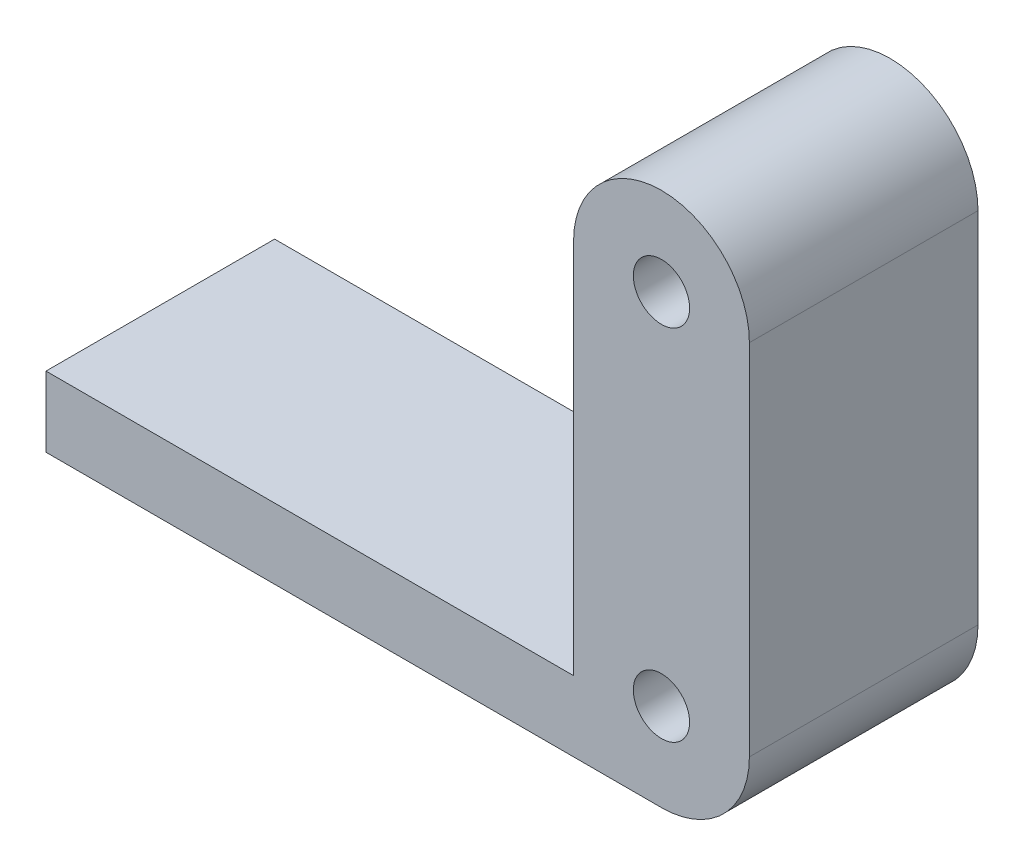
ISO-10303-21;
HEADER;
FILE_DESCRIPTION(('STEP AP214'),'2;1');
FILE_NAME('part.step','',(''),(''),'','','');
FILE_SCHEMA(('AUTOMOTIVE_DESIGN { 1 0 10303 214 1 1 1 1 }'));
ENDSEC;
DATA;
#1=APPLICATION_CONTEXT('core data for automotive mechanical design processes');
#2=APPLICATION_PROTOCOL_DEFINITION('international standard','automotive_design',2000,#1);
#3=PRODUCT_CONTEXT('',#1,'mechanical');
#4=PRODUCT('Part','Part','',(#3));
#5=PRODUCT_RELATED_PRODUCT_CATEGORY('part','',(#4));
#6=PRODUCT_DEFINITION_FORMATION('','',#4);
#7=PRODUCT_DEFINITION_CONTEXT('part definition',#1,'design');
#8=PRODUCT_DEFINITION('design','',#6,#7);
#9=PRODUCT_DEFINITION_SHAPE('','',#8);
#10=(LENGTH_UNIT() NAMED_UNIT(*) SI_UNIT(.MILLI.,.METRE.));
#11=(NAMED_UNIT(*) PLANE_ANGLE_UNIT() SI_UNIT($,.RADIAN.));
#12=(NAMED_UNIT(*) SI_UNIT($,.STERADIAN.) SOLID_ANGLE_UNIT());
#13=UNCERTAINTY_MEASURE_WITH_UNIT(LENGTH_MEASURE(1.E-05),#10,'distance_accuracy_value','');
#14=(GEOMETRIC_REPRESENTATION_CONTEXT(3) GLOBAL_UNCERTAINTY_ASSIGNED_CONTEXT((#13)) GLOBAL_UNIT_ASSIGNED_CONTEXT((#10,
#11,#12)) REPRESENTATION_CONTEXT('',''));
#15=CARTESIAN_POINT('',(0.,0.,0.));
#16=DIRECTION('',(0.,0.,1.));
#17=DIRECTION('',(1.,0.,0.));
#18=AXIS2_PLACEMENT_3D('',#15,#16,#17);
#19=CARTESIAN_POINT('',(35.,0.999999999999997,13.));
#20=DIRECTION('',(0.,0.,-1.));
#21=DIRECTION('',(-1.,0.,0.));
#22=AXIS2_PLACEMENT_3D('',#19,#20,#21);
#23=CYLINDRICAL_SURFACE('',#22,5.);
#24=DIRECTION('',(0.,0.,-1.));
#25=VECTOR('',#24,1.);
#26=CARTESIAN_POINT('',(40.,1.,13.));
#27=LINE('',#26,#25);
#28=CARTESIAN_POINT('',(40.,1.,13.));
#29=VERTEX_POINT('',#28);
#30=CARTESIAN_POINT('',(40.,1.,0.));
#31=VERTEX_POINT('',#30);
#32=EDGE_CURVE('E148',#29,#31,#27,.T.);
#33=ORIENTED_EDGE('',*,*,#32,.F.);
#34=CARTESIAN_POINT('',(35.,0.999999999999997,13.));
#35=DIRECTION('',(0.,0.,-1.));
#36=DIRECTION('',(-1.,0.,0.));
#37=AXIS2_PLACEMENT_3D('',#34,#35,#36);
#38=CIRCLE('',#37,5.);
#39=CARTESIAN_POINT('',(35.,-4.,13.));
#40=VERTEX_POINT('',#39);
#41=EDGE_CURVE('E49',#40,#29,#38,.F.);
#42=ORIENTED_EDGE('',*,*,#41,.F.);
#43=DIRECTION('',(0.,0.,-1.));
#44=VECTOR('',#43,1.);
#45=CARTESIAN_POINT('',(35.,-4.,13.));
#46=LINE('',#45,#44);
#47=CARTESIAN_POINT('',(35.,-4.,0.));
#48=VERTEX_POINT('',#47);
#49=EDGE_CURVE('E104',#48,#40,#46,.F.);
#50=ORIENTED_EDGE('',*,*,#49,.F.);
#51=CARTESIAN_POINT('',(35.,0.999999999999997,0.));
#52=DIRECTION('',(0.,0.,-1.));
#53=DIRECTION('',(-1.,0.,0.));
#54=AXIS2_PLACEMENT_3D('',#51,#52,#53);
#55=CIRCLE('',#54,5.);
#56=EDGE_CURVE('E11',#31,#48,#55,.T.);
#57=ORIENTED_EDGE('',*,*,#56,.F.);
#58=EDGE_LOOP('',(#33,#42,#50,#57));
#59=FACE_BOUND('',#58,.T.);
#60=ADVANCED_FACE('F41',(#59),#23,.T.);
#61=CARTESIAN_POINT('',(35.,21.4,0.));
#62=DIRECTION('',(0.,0.,-1.));
#63=DIRECTION('',(-1.,0.,0.));
#64=AXIS2_PLACEMENT_3D('',#61,#62,#63);
#65=CYLINDRICAL_SURFACE('',#64,5.00000000000001);
#66=DIRECTION('',(0.,0.,-1.));
#67=VECTOR('',#66,1.);
#68=CARTESIAN_POINT('',(40.,21.4,13.));
#69=LINE('',#68,#67);
#70=CARTESIAN_POINT('',(40.,21.4,0.));
#71=VERTEX_POINT('',#70);
#72=CARTESIAN_POINT('',(40.,21.4,13.));
#73=VERTEX_POINT('',#72);
#74=EDGE_CURVE('E125',#71,#73,#69,.F.);
#75=ORIENTED_EDGE('',*,*,#74,.F.);
#76=CARTESIAN_POINT('',(35.,21.4,0.));
#77=DIRECTION('',(0.,0.,-1.));
#78=DIRECTION('',(-1.,0.,0.));
#79=AXIS2_PLACEMENT_3D('',#76,#77,#78);
#80=CIRCLE('',#79,5.00000000000001);
#81=CARTESIAN_POINT('',(30.,21.4,0.));
#82=VERTEX_POINT('',#81);
#83=EDGE_CURVE('E141',#82,#71,#80,.T.);
#84=ORIENTED_EDGE('',*,*,#83,.F.);
#85=DIRECTION('',(0.,0.,-1.));
#86=VECTOR('',#85,1.);
#87=CARTESIAN_POINT('',(30.,21.4,13.));
#88=LINE('',#87,#86);
#89=CARTESIAN_POINT('',(30.,21.4,13.));
#90=VERTEX_POINT('',#89);
#91=EDGE_CURVE('E131',#90,#82,#88,.T.);
#92=ORIENTED_EDGE('',*,*,#91,.F.);
#93=CARTESIAN_POINT('',(35.,21.4,13.));
#94=DIRECTION('',(0.,0.,-1.));
#95=DIRECTION('',(-1.,0.,0.));
#96=AXIS2_PLACEMENT_3D('',#93,#94,#95);
#97=CIRCLE('',#96,5.00000000000001);
#98=EDGE_CURVE('E145',#73,#90,#97,.F.);
#99=ORIENTED_EDGE('',*,*,#98,.F.);
#100=EDGE_LOOP('',(#75,#84,#92,#99));
#101=FACE_BOUND('',#100,.T.);
#102=ADVANCED_FACE('F193',(#101),#65,.T.);
#103=CARTESIAN_POINT('',(0.,0.,13.));
#104=DIRECTION('',(0.,0.,-1.));
#105=DIRECTION('',(-1.,0.,0.));
#106=AXIS2_PLACEMENT_3D('',#103,#104,#105);
#107=PLANE('',#106);
#108=DIRECTION('',(1.,0.,0.));
#109=VECTOR('',#108,1.);
#110=CARTESIAN_POINT('',(40.,-4.,13.));
#111=LINE('',#110,#109);
#112=CARTESIAN_POINT('',(0.,-4.00000000000001,13.));
#113=VERTEX_POINT('',#112);
#114=EDGE_CURVE('E97',#113,#40,#111,.T.);
#115=ORIENTED_EDGE('',*,*,#114,.T.);
#116=ORIENTED_EDGE('',*,*,#41,.T.);
#117=DIRECTION('',(0.,1.,0.));
#118=VECTOR('',#117,1.);
#119=CARTESIAN_POINT('',(40.,26.4,13.));
#120=LINE('',#119,#118);
#121=EDGE_CURVE('E107',#29,#73,#120,.T.);
#122=ORIENTED_EDGE('',*,*,#121,.T.);
#123=ORIENTED_EDGE('',*,*,#98,.T.);
#124=DIRECTION('',(0.,-1.,0.));
#125=VECTOR('',#124,1.);
#126=CARTESIAN_POINT('',(30.,0.,13.));
#127=LINE('',#126,#125);
#128=CARTESIAN_POINT('',(30.,0.,13.));
#129=VERTEX_POINT('',#128);
#130=EDGE_CURVE('E160',#90,#129,#127,.T.);
#131=ORIENTED_EDGE('',*,*,#130,.T.);
#132=DIRECTION('',(-1.,0.,0.));
#133=VECTOR('',#132,1.);
#134=CARTESIAN_POINT('',(0.,0.,13.));
#135=LINE('',#134,#133);
#136=CARTESIAN_POINT('',(0.,0.,13.));
#137=VERTEX_POINT('',#136);
#138=EDGE_CURVE('E114',#129,#137,#135,.T.);
#139=ORIENTED_EDGE('',*,*,#138,.T.);
#140=DIRECTION('',(0.,-1.,0.));
#141=VECTOR('',#140,1.);
#142=CARTESIAN_POINT('',(0.,-4.00000000000001,13.));
#143=LINE('',#142,#141);
#144=EDGE_CURVE('E108',#137,#113,#143,.T.);
#145=ORIENTED_EDGE('',*,*,#144,.T.);
#146=EDGE_LOOP('',(#115,#116,#122,#123,#131,#139,#145));
#147=FACE_BOUND('',#146,.T.);
#148=CARTESIAN_POINT('',(35.,21.4,13.));
#149=DIRECTION('',(0.,0.,1.));
#150=DIRECTION('',(1.,0.,0.));
#151=AXIS2_PLACEMENT_3D('',#148,#149,#150);
#152=CIRCLE('',#151,1.6);
#153=CARTESIAN_POINT('',(33.4,21.4,13.));
#154=VERTEX_POINT('',#153);
#155=EDGE_CURVE('E170',#154,#154,#152,.T.);
#156=ORIENTED_EDGE('',*,*,#155,.F.);
#157=EDGE_LOOP('',(#156));
#158=FACE_BOUND('',#157,.T.);
#159=CARTESIAN_POINT('',(35.,0.999999999999997,13.));
#160=DIRECTION('',(0.,0.,1.));
#161=DIRECTION('',(1.,0.,0.));
#162=AXIS2_PLACEMENT_3D('',#159,#160,#161);
#163=CIRCLE('',#162,1.6);
#164=CARTESIAN_POINT('',(33.4,0.999999999999997,13.));
#165=VERTEX_POINT('',#164);
#166=EDGE_CURVE('E229',#165,#165,#163,.T.);
#167=ORIENTED_EDGE('',*,*,#166,.F.);
#168=EDGE_LOOP('',(#167));
#169=FACE_BOUND('',#168,.T.);
#170=ADVANCED_FACE('F111',(#147,#158,#169),#107,.F.);
#171=CARTESIAN_POINT('',(0.,0.,0.));
#172=DIRECTION('',(0.,0.,-1.));
#173=DIRECTION('',(-1.,0.,0.));
#174=AXIS2_PLACEMENT_3D('',#171,#172,#173);
#175=PLANE('',#174);
#176=CARTESIAN_POINT('',(35.,21.4,0.));
#177=DIRECTION('',(0.,0.,1.));
#178=DIRECTION('',(1.,0.,0.));
#179=AXIS2_PLACEMENT_3D('',#176,#177,#178);
#180=CIRCLE('',#179,1.6);
#181=CARTESIAN_POINT('',(33.4,21.4,0.));
#182=VERTEX_POINT('',#181);
#183=EDGE_CURVE('E236',#182,#182,#180,.T.);
#184=ORIENTED_EDGE('',*,*,#183,.T.);
#185=EDGE_LOOP('',(#184));
#186=FACE_BOUND('',#185,.T.);
#187=DIRECTION('',(0.,1.,0.));
#188=VECTOR('',#187,1.);
#189=CARTESIAN_POINT('',(40.,26.4,0.));
#190=LINE('',#189,#188);
#191=EDGE_CURVE('E173',#31,#71,#190,.T.);
#192=ORIENTED_EDGE('',*,*,#191,.F.);
#193=ORIENTED_EDGE('',*,*,#56,.T.);
#194=DIRECTION('',(1.,0.,0.));
#195=VECTOR('',#194,1.);
#196=CARTESIAN_POINT('',(40.,-4.,0.));
#197=LINE('',#196,#195);
#198=CARTESIAN_POINT('',(0.,-4.00000000000001,0.));
#199=VERTEX_POINT('',#198);
#200=EDGE_CURVE('E169',#199,#48,#197,.T.);
#201=ORIENTED_EDGE('',*,*,#200,.F.);
#202=DIRECTION('',(0.,-1.,0.));
#203=VECTOR('',#202,1.);
#204=CARTESIAN_POINT('',(0.,-4.00000000000001,0.));
#205=LINE('',#204,#203);
#206=CARTESIAN_POINT('',(0.,0.,0.));
#207=VERTEX_POINT('',#206);
#208=EDGE_CURVE('E123',#207,#199,#205,.T.);
#209=ORIENTED_EDGE('',*,*,#208,.F.);
#210=DIRECTION('',(-1.,0.,0.));
#211=VECTOR('',#210,1.);
#212=CARTESIAN_POINT('',(0.,0.,0.));
#213=LINE('',#212,#211);
#214=CARTESIAN_POINT('',(30.,0.,0.));
#215=VERTEX_POINT('',#214);
#216=EDGE_CURVE('E119',#215,#207,#213,.T.);
#217=ORIENTED_EDGE('',*,*,#216,.F.);
#218=DIRECTION('',(0.,-1.,0.));
#219=VECTOR('',#218,1.);
#220=CARTESIAN_POINT('',(30.,0.,0.));
#221=LINE('',#220,#219);
#222=EDGE_CURVE('E176',#82,#215,#221,.T.);
#223=ORIENTED_EDGE('',*,*,#222,.F.);
#224=ORIENTED_EDGE('',*,*,#83,.T.);
#225=EDGE_LOOP('',(#192,#193,#201,#209,#217,#223,#224));
#226=FACE_BOUND('',#225,.T.);
#227=CARTESIAN_POINT('',(35.,0.999999999999997,0.));
#228=DIRECTION('',(0.,0.,1.));
#229=DIRECTION('',(1.,0.,0.));
#230=AXIS2_PLACEMENT_3D('',#227,#228,#229);
#231=CIRCLE('',#230,1.6);
#232=CARTESIAN_POINT('',(33.4,0.999999999999997,0.));
#233=VERTEX_POINT('',#232);
#234=EDGE_CURVE('E232',#233,#233,#231,.T.);
#235=ORIENTED_EDGE('',*,*,#234,.T.);
#236=EDGE_LOOP('',(#235));
#237=FACE_BOUND('',#236,.T.);
#238=ADVANCED_FACE('F183',(#186,#226,#237),#175,.T.);
#239=CARTESIAN_POINT('',(0.,-4.00000000000001,13.));
#240=DIRECTION('',(1.,0.,0.));
#241=DIRECTION('',(0.,0.,-1.));
#242=AXIS2_PLACEMENT_3D('',#239,#240,#241);
#243=PLANE('',#242);
#244=ORIENTED_EDGE('',*,*,#208,.T.);
#245=DIRECTION('',(0.,0.,-1.));
#246=VECTOR('',#245,1.);
#247=CARTESIAN_POINT('',(0.,-4.00000000000001,13.));
#248=LINE('',#247,#246);
#249=EDGE_CURVE('E102',#113,#199,#248,.T.);
#250=ORIENTED_EDGE('',*,*,#249,.F.);
#251=ORIENTED_EDGE('',*,*,#144,.F.);
#252=DIRECTION('',(0.,0.,-1.));
#253=VECTOR('',#252,1.);
#254=CARTESIAN_POINT('',(0.,0.,13.));
#255=LINE('',#254,#253);
#256=EDGE_CURVE('E134',#137,#207,#255,.T.);
#257=ORIENTED_EDGE('',*,*,#256,.T.);
#258=EDGE_LOOP('',(#244,#250,#251,#257));
#259=FACE_BOUND('',#258,.T.);
#260=ADVANCED_FACE('F121',(#259),#243,.F.);
#261=CARTESIAN_POINT('',(40.,-4.,13.));
#262=DIRECTION('',(0.,1.,0.));
#263=DIRECTION('',(-1.,0.,0.));
#264=AXIS2_PLACEMENT_3D('',#261,#262,#263);
#265=PLANE('',#264);
#266=ORIENTED_EDGE('',*,*,#200,.T.);
#267=ORIENTED_EDGE('',*,*,#49,.T.);
#268=ORIENTED_EDGE('',*,*,#114,.F.);
#269=ORIENTED_EDGE('',*,*,#249,.T.);
#270=EDGE_LOOP('',(#266,#267,#268,#269));
#271=FACE_BOUND('',#270,.T.);
#272=ADVANCED_FACE('F100',(#271),#265,.F.);
#273=CARTESIAN_POINT('',(40.,26.4,13.));
#274=DIRECTION('',(-1.,0.,0.));
#275=DIRECTION('',(0.,-1.,0.));
#276=AXIS2_PLACEMENT_3D('',#273,#274,#275);
#277=PLANE('',#276);
#278=ORIENTED_EDGE('',*,*,#121,.F.);
#279=ORIENTED_EDGE('',*,*,#32,.T.);
#280=ORIENTED_EDGE('',*,*,#191,.T.);
#281=ORIENTED_EDGE('',*,*,#74,.T.);
#282=EDGE_LOOP('',(#278,#279,#280,#281));
#283=FACE_BOUND('',#282,.T.);
#284=ADVANCED_FACE('F157',(#283),#277,.F.);
#285=CARTESIAN_POINT('',(30.,0.,13.));
#286=DIRECTION('',(1.,0.,0.));
#287=DIRECTION('',(0.,0.,-1.));
#288=AXIS2_PLACEMENT_3D('',#285,#286,#287);
#289=PLANE('',#288);
#290=ORIENTED_EDGE('',*,*,#130,.F.);
#291=ORIENTED_EDGE('',*,*,#91,.T.);
#292=ORIENTED_EDGE('',*,*,#222,.T.);
#293=DIRECTION('',(0.,0.,-1.));
#294=VECTOR('',#293,1.);
#295=CARTESIAN_POINT('',(30.,0.,13.));
#296=LINE('',#295,#294);
#297=EDGE_CURVE('E126',#129,#215,#296,.T.);
#298=ORIENTED_EDGE('',*,*,#297,.F.);
#299=EDGE_LOOP('',(#290,#291,#292,#298));
#300=FACE_BOUND('',#299,.T.);
#301=ADVANCED_FACE('F190',(#300),#289,.F.);
#302=CARTESIAN_POINT('',(0.,0.,13.));
#303=DIRECTION('',(0.,-1.,0.));
#304=DIRECTION('',(0.,0.,-1.));
#305=AXIS2_PLACEMENT_3D('',#302,#303,#304);
#306=PLANE('',#305);
#307=ORIENTED_EDGE('',*,*,#216,.T.);
#308=ORIENTED_EDGE('',*,*,#256,.F.);
#309=ORIENTED_EDGE('',*,*,#138,.F.);
#310=ORIENTED_EDGE('',*,*,#297,.T.);
#311=EDGE_LOOP('',(#307,#308,#309,#310));
#312=FACE_BOUND('',#311,.T.);
#313=ADVANCED_FACE('F186',(#312),#306,.F.);
#314=CARTESIAN_POINT('',(35.,21.4,13.));
#315=DIRECTION('',(0.,0.,-1.));
#316=DIRECTION('',(-1.,0.,0.));
#317=AXIS2_PLACEMENT_3D('',#314,#315,#316);
#318=CYLINDRICAL_SURFACE('',#317,1.6);
#319=CARTESIAN_POINT('',(33.4,21.4,13.));
#320=CARTESIAN_POINT('',(33.4,21.4,12.8645833333333));
#321=CARTESIAN_POINT('',(33.4,21.4,12.7291666666667));
#322=CARTESIAN_POINT('',(33.4,21.4,12.4583333333333));
#323=CARTESIAN_POINT('',(33.4,21.4,12.3229166666667));
#324=CARTESIAN_POINT('',(33.4,21.4,12.0520833333333));
#325=CARTESIAN_POINT('',(33.4,21.4,11.9166666666667));
#326=CARTESIAN_POINT('',(33.4,21.4,11.6458333333333));
#327=CARTESIAN_POINT('',(33.4,21.4,11.5104166666667));
#328=CARTESIAN_POINT('',(33.4,21.4,11.2395833333333));
#329=CARTESIAN_POINT('',(33.4,21.4,11.1041666666667));
#330=CARTESIAN_POINT('',(33.4,21.4,10.8333333333333));
#331=CARTESIAN_POINT('',(33.4,21.4,10.6979166666667));
#332=CARTESIAN_POINT('',(33.4,21.4,10.4270833333333));
#333=CARTESIAN_POINT('',(33.4,21.4,10.2916666666667));
#334=CARTESIAN_POINT('',(33.4,21.4,10.0208333333333));
#335=CARTESIAN_POINT('',(33.4,21.4,9.88541666666667));
#336=CARTESIAN_POINT('',(33.4,21.4,9.61458333333333));
#337=CARTESIAN_POINT('',(33.4,21.4,9.47916666666667));
#338=CARTESIAN_POINT('',(33.4,21.4,9.20833333333333));
#339=CARTESIAN_POINT('',(33.4,21.4,9.07291666666666));
#340=CARTESIAN_POINT('',(33.4,21.4,8.80208333333333));
#341=CARTESIAN_POINT('',(33.4,21.4,8.66666666666667));
#342=CARTESIAN_POINT('',(33.4,21.4,8.39583333333333));
#343=CARTESIAN_POINT('',(33.4,21.4,8.26041666666667));
#344=CARTESIAN_POINT('',(33.4,21.4,7.98958333333333));
#345=CARTESIAN_POINT('',(33.4,21.4,7.85416666666667));
#346=CARTESIAN_POINT('',(33.4,21.4,7.58333333333333));
#347=CARTESIAN_POINT('',(33.4,21.4,7.44791666666667));
#348=CARTESIAN_POINT('',(33.4,21.4,7.17708333333333));
#349=CARTESIAN_POINT('',(33.4,21.4,7.04166666666667));
#350=CARTESIAN_POINT('',(33.4,21.4,6.77083333333333));
#351=CARTESIAN_POINT('',(33.4,21.4,6.63541666666667));
#352=CARTESIAN_POINT('',(33.4,21.4,6.36458333333333));
#353=CARTESIAN_POINT('',(33.4,21.4,6.22916666666667));
#354=CARTESIAN_POINT('',(33.4,21.4,5.95833333333333));
#355=CARTESIAN_POINT('',(33.4,21.4,5.82291666666667));
#356=CARTESIAN_POINT('',(33.4,21.4,5.55208333333333));
#357=CARTESIAN_POINT('',(33.4,21.4,5.41666666666667));
#358=CARTESIAN_POINT('',(33.4,21.4,5.14583333333333));
#359=CARTESIAN_POINT('',(33.4,21.4,5.01041666666667));
#360=CARTESIAN_POINT('',(33.4,21.4,4.73958333333333));
#361=CARTESIAN_POINT('',(33.4,21.4,4.60416666666667));
#362=CARTESIAN_POINT('',(33.4,21.4,4.33333333333333));
#363=CARTESIAN_POINT('',(33.4,21.4,4.19791666666667));
#364=CARTESIAN_POINT('',(33.4,21.4,3.92708333333333));
#365=CARTESIAN_POINT('',(33.4,21.4,3.79166666666667));
#366=CARTESIAN_POINT('',(33.4,21.4,3.52083333333333));
#367=CARTESIAN_POINT('',(33.4,21.4,3.38541666666667));
#368=CARTESIAN_POINT('',(33.4,21.4,3.11458333333333));
#369=CARTESIAN_POINT('',(33.4,21.4,2.97916666666667));
#370=CARTESIAN_POINT('',(33.4,21.4,2.70833333333333));
#371=CARTESIAN_POINT('',(33.4,21.4,2.57291666666667));
#372=CARTESIAN_POINT('',(33.4,21.4,2.30208333333333));
#373=CARTESIAN_POINT('',(33.4,21.4,2.16666666666667));
#374=CARTESIAN_POINT('',(33.4,21.4,1.89583333333333));
#375=CARTESIAN_POINT('',(33.4,21.4,1.76041666666667));
#376=CARTESIAN_POINT('',(33.4,21.4,1.48958333333333));
#377=CARTESIAN_POINT('',(33.4,21.4,1.35416666666667));
#378=CARTESIAN_POINT('',(33.4,21.4,1.08333333333333));
#379=CARTESIAN_POINT('',(33.4,21.4,0.947916666666667));
#380=CARTESIAN_POINT('',(33.4,21.4,0.677083333333334));
#381=CARTESIAN_POINT('',(33.4,21.4,0.541666666666667));
#382=CARTESIAN_POINT('',(33.4,21.4,0.270833333333334));
#383=CARTESIAN_POINT('',(33.4,21.4,0.135416666666667));
#384=CARTESIAN_POINT('',(33.4,21.4,0.));
#385=B_SPLINE_CURVE_WITH_KNOTS('',3,(#319,#320,#321,#322,#323,#324,#325,#326,#327,#328,#329,
#330,#331,#332,#333,#334,#335,#336,#337,#338,#339,#340,#341,#342,#343,#344,#345,#346,#347,#348,
#349,#350,#351,#352,#353,#354,#355,#356,#357,#358,#359,#360,#361,#362,#363,#364,#365,#366,#367,
#368,#369,#370,#371,#372,#373,#374,#375,#376,#377,#378,#379,#380,#381,#382,#383,#384),
.UNSPECIFIED.,.F.,.F.,(4,2,2,2,2,2,2,2,2,2,2,2,2,2,2,2,2,2,2,2,2,2,2,2,2,2,2,2,2,2,2,2,4),(0.,
0.40625,0.812500000000001,1.21875,1.625,2.03125,2.4375,2.84375,3.25,3.65625,4.0625,4.46875,
4.875,5.28125,5.6875,6.09375,6.5,6.90625,7.3125,7.71875,8.125,8.53125,8.9375,9.34375,9.75,
10.15625,10.5625,10.96875,11.375,11.78125,12.1875,12.59375,13.),.UNSPECIFIED.);
#386=EDGE_CURVE('BSEAM214',#154,#182,#385,.T.);
#387=ORIENTED_EDGE('',*,*,#155,.T.);
#388=ORIENTED_EDGE('',*,*,#183,.F.);
#389=ORIENTED_EDGE('',*,*,#386,.T.);
#390=ORIENTED_EDGE('',*,*,#386,.F.);
#391=EDGE_LOOP('',(#387,#389,#388,#390));
#392=FACE_BOUND('',#391,.T.);
#393=ADVANCED_FACE('F214',(#392),#318,.F.);
#394=CARTESIAN_POINT('',(35.,0.999999999999997,13.));
#395=DIRECTION('',(0.,0.,-1.));
#396=DIRECTION('',(-1.,0.,0.));
#397=AXIS2_PLACEMENT_3D('',#394,#395,#396);
#398=CYLINDRICAL_SURFACE('',#397,1.6);
#399=CARTESIAN_POINT('',(33.4,0.999999999999997,13.));
#400=CARTESIAN_POINT('',(33.4,0.999999999999997,12.8645833333333));
#401=CARTESIAN_POINT('',(33.4,0.999999999999997,12.7291666666667));
#402=CARTESIAN_POINT('',(33.4,0.999999999999997,12.4583333333333));
#403=CARTESIAN_POINT('',(33.4,0.999999999999997,12.3229166666667));
#404=CARTESIAN_POINT('',(33.4,0.999999999999997,12.0520833333333));
#405=CARTESIAN_POINT('',(33.4,0.999999999999997,11.9166666666667));
#406=CARTESIAN_POINT('',(33.4,0.999999999999997,11.6458333333333));
#407=CARTESIAN_POINT('',(33.4,0.999999999999997,11.5104166666667));
#408=CARTESIAN_POINT('',(33.4,0.999999999999997,11.2395833333333));
#409=CARTESIAN_POINT('',(33.4,0.999999999999997,11.1041666666667));
#410=CARTESIAN_POINT('',(33.4,0.999999999999997,10.8333333333333));
#411=CARTESIAN_POINT('',(33.4,0.999999999999997,10.6979166666667));
#412=CARTESIAN_POINT('',(33.4,0.999999999999997,10.4270833333333));
#413=CARTESIAN_POINT('',(33.4,0.999999999999997,10.2916666666667));
#414=CARTESIAN_POINT('',(33.4,0.999999999999997,10.0208333333333));
#415=CARTESIAN_POINT('',(33.4,0.999999999999997,9.88541666666667));
#416=CARTESIAN_POINT('',(33.4,0.999999999999997,9.61458333333333));
#417=CARTESIAN_POINT('',(33.4,0.999999999999997,9.47916666666667));
#418=CARTESIAN_POINT('',(33.4,0.999999999999997,9.20833333333333));
#419=CARTESIAN_POINT('',(33.4,0.999999999999997,9.07291666666666));
#420=CARTESIAN_POINT('',(33.4,0.999999999999997,8.80208333333333));
#421=CARTESIAN_POINT('',(33.4,0.999999999999997,8.66666666666667));
#422=CARTESIAN_POINT('',(33.4,0.999999999999997,8.39583333333333));
#423=CARTESIAN_POINT('',(33.4,0.999999999999997,8.26041666666667));
#424=CARTESIAN_POINT('',(33.4,0.999999999999997,7.98958333333333));
#425=CARTESIAN_POINT('',(33.4,0.999999999999997,7.85416666666667));
#426=CARTESIAN_POINT('',(33.4,0.999999999999997,7.58333333333333));
#427=CARTESIAN_POINT('',(33.4,0.999999999999997,7.44791666666667));
#428=CARTESIAN_POINT('',(33.4,0.999999999999997,7.17708333333333));
#429=CARTESIAN_POINT('',(33.4,0.999999999999997,7.04166666666667));
#430=CARTESIAN_POINT('',(33.4,0.999999999999997,6.77083333333333));
#431=CARTESIAN_POINT('',(33.4,0.999999999999997,6.63541666666667));
#432=CARTESIAN_POINT('',(33.4,0.999999999999997,6.36458333333333));
#433=CARTESIAN_POINT('',(33.4,0.999999999999997,6.22916666666667));
#434=CARTESIAN_POINT('',(33.4,0.999999999999997,5.95833333333333));
#435=CARTESIAN_POINT('',(33.4,0.999999999999997,5.82291666666667));
#436=CARTESIAN_POINT('',(33.4,0.999999999999997,5.55208333333333));
#437=CARTESIAN_POINT('',(33.4,0.999999999999997,5.41666666666667));
#438=CARTESIAN_POINT('',(33.4,0.999999999999997,5.14583333333333));
#439=CARTESIAN_POINT('',(33.4,0.999999999999997,5.01041666666667));
#440=CARTESIAN_POINT('',(33.4,0.999999999999997,4.73958333333333));
#441=CARTESIAN_POINT('',(33.4,0.999999999999997,4.60416666666667));
#442=CARTESIAN_POINT('',(33.4,0.999999999999997,4.33333333333333));
#443=CARTESIAN_POINT('',(33.4,0.999999999999997,4.19791666666667));
#444=CARTESIAN_POINT('',(33.4,0.999999999999997,3.92708333333333));
#445=CARTESIAN_POINT('',(33.4,0.999999999999997,3.79166666666667));
#446=CARTESIAN_POINT('',(33.4,0.999999999999997,3.52083333333333));
#447=CARTESIAN_POINT('',(33.4,0.999999999999997,3.38541666666667));
#448=CARTESIAN_POINT('',(33.4,0.999999999999997,3.11458333333333));
#449=CARTESIAN_POINT('',(33.4,0.999999999999997,2.97916666666667));
#450=CARTESIAN_POINT('',(33.4,0.999999999999997,2.70833333333333));
#451=CARTESIAN_POINT('',(33.4,0.999999999999997,2.57291666666667));
#452=CARTESIAN_POINT('',(33.4,0.999999999999997,2.30208333333333));
#453=CARTESIAN_POINT('',(33.4,0.999999999999997,2.16666666666667));
#454=CARTESIAN_POINT('',(33.4,0.999999999999997,1.89583333333333));
#455=CARTESIAN_POINT('',(33.4,0.999999999999997,1.76041666666667));
#456=CARTESIAN_POINT('',(33.4,0.999999999999997,1.48958333333333));
#457=CARTESIAN_POINT('',(33.4,0.999999999999997,1.35416666666667));
#458=CARTESIAN_POINT('',(33.4,0.999999999999997,1.08333333333333));
#459=CARTESIAN_POINT('',(33.4,0.999999999999997,0.947916666666667));
#460=CARTESIAN_POINT('',(33.4,0.999999999999997,0.677083333333334));
#461=CARTESIAN_POINT('',(33.4,0.999999999999997,0.541666666666667));
#462=CARTESIAN_POINT('',(33.4,0.999999999999997,0.270833333333334));
#463=CARTESIAN_POINT('',(33.4,0.999999999999997,0.135416666666667));
#464=CARTESIAN_POINT('',(33.4,0.999999999999997,0.));
#465=B_SPLINE_CURVE_WITH_KNOTS('',3,(#399,#400,#401,#402,#403,#404,#405,#406,#407,#408,#409,
#410,#411,#412,#413,#414,#415,#416,#417,#418,#419,#420,#421,#422,#423,#424,#425,#426,#427,#428,
#429,#430,#431,#432,#433,#434,#435,#436,#437,#438,#439,#440,#441,#442,#443,#444,#445,#446,#447,
#448,#449,#450,#451,#452,#453,#454,#455,#456,#457,#458,#459,#460,#461,#462,#463,#464),
.UNSPECIFIED.,.F.,.F.,(4,2,2,2,2,2,2,2,2,2,2,2,2,2,2,2,2,2,2,2,2,2,2,2,2,2,2,2,2,2,2,2,4),(0.,
0.40625,0.812500000000001,1.21875,1.625,2.03125,2.4375,2.84375,3.25,3.65625,4.0625,4.46875,
4.875,5.28125,5.6875,6.09375,6.5,6.90625,7.3125,7.71875,8.125,8.53125,8.9375,9.34375,9.75,
10.15625,10.5625,10.96875,11.375,11.78125,12.1875,12.59375,13.),.UNSPECIFIED.);
#466=EDGE_CURVE('BSEAM220',#165,#233,#465,.T.);
#467=ORIENTED_EDGE('',*,*,#166,.T.);
#468=ORIENTED_EDGE('',*,*,#234,.F.);
#469=ORIENTED_EDGE('',*,*,#466,.T.);
#470=ORIENTED_EDGE('',*,*,#466,.F.);
#471=EDGE_LOOP('',(#467,#469,#468,#470));
#472=FACE_BOUND('',#471,.T.);
#473=ADVANCED_FACE('F220',(#472),#398,.F.);
#474=CLOSED_SHELL('',(#60,#102,#170,#238,#260,#272,#284,#301,#313,#393,#473));
#475=MANIFOLD_SOLID_BREP('B2',#474);
#476=ADVANCED_BREP_SHAPE_REPRESENTATION('',(#18,#475),#14);
#477=SHAPE_DEFINITION_REPRESENTATION(#9,#476);
ENDSEC;
END-ISO-10303-21;
